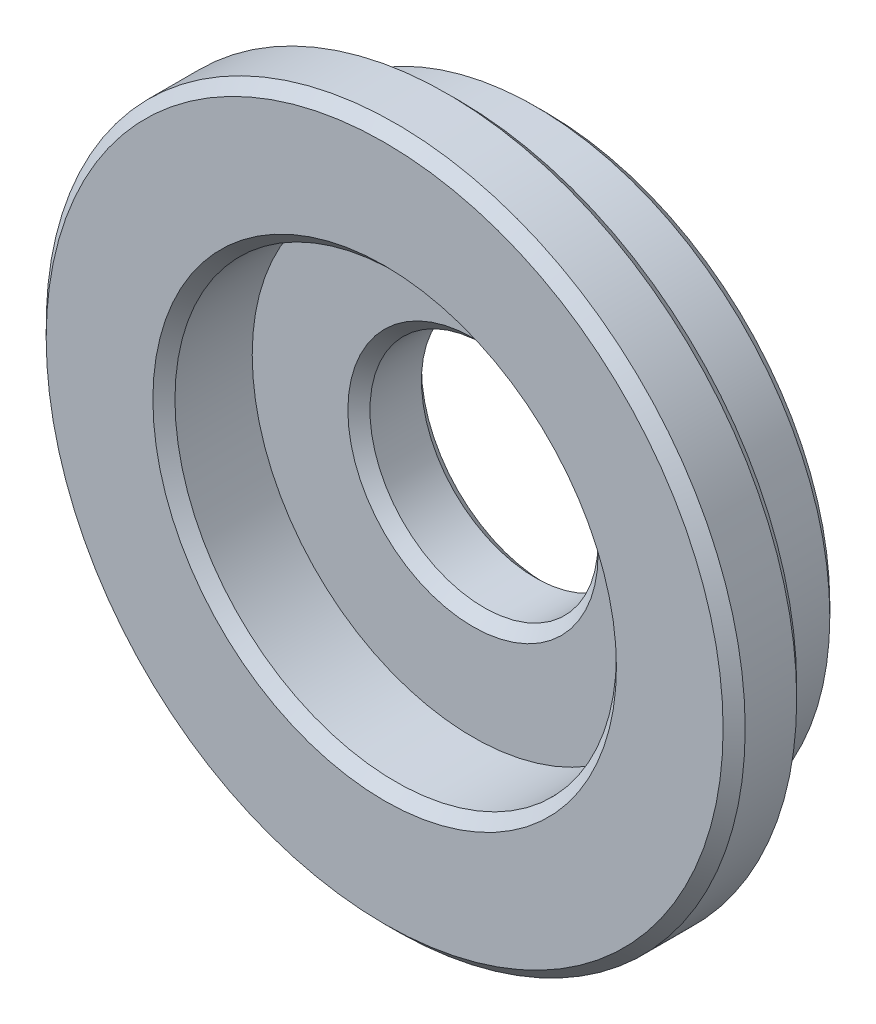
ISO-10303-21;
HEADER;
FILE_DESCRIPTION(('STEP AP214'),'2;1');
FILE_NAME('part.step','',(''),(''),'','','');
FILE_SCHEMA(('AUTOMOTIVE_DESIGN { 1 0 10303 214 1 1 1 1 }'));
ENDSEC;
DATA;
#1=APPLICATION_CONTEXT('core data for automotive mechanical design processes');
#2=APPLICATION_PROTOCOL_DEFINITION('international standard','automotive_design',2000,#1);
#3=PRODUCT_CONTEXT('',#1,'mechanical');
#4=PRODUCT('Part','Part','',(#3));
#5=PRODUCT_RELATED_PRODUCT_CATEGORY('part','',(#4));
#6=PRODUCT_DEFINITION_FORMATION('','',#4);
#7=PRODUCT_DEFINITION_CONTEXT('part definition',#1,'design');
#8=PRODUCT_DEFINITION('design','',#6,#7);
#9=PRODUCT_DEFINITION_SHAPE('','',#8);
#10=(LENGTH_UNIT() NAMED_UNIT(*) SI_UNIT(.MILLI.,.METRE.));
#11=(NAMED_UNIT(*) PLANE_ANGLE_UNIT() SI_UNIT($,.RADIAN.));
#12=(NAMED_UNIT(*) SI_UNIT($,.STERADIAN.) SOLID_ANGLE_UNIT());
#13=UNCERTAINTY_MEASURE_WITH_UNIT(LENGTH_MEASURE(1.E-05),#10,'distance_accuracy_value','');
#14=(GEOMETRIC_REPRESENTATION_CONTEXT(3) GLOBAL_UNCERTAINTY_ASSIGNED_CONTEXT((#13)) GLOBAL_UNIT_ASSIGNED_CONTEXT((#10,
#11,#12)) REPRESENTATION_CONTEXT('',''));
#15=CARTESIAN_POINT('',(0.,0.,0.));
#16=DIRECTION('',(0.,0.,1.));
#17=DIRECTION('',(1.,0.,0.));
#18=AXIS2_PLACEMENT_3D('',#15,#16,#17);
#19=CARTESIAN_POINT('',(0.,0.,0.850000000039108));
#20=DIRECTION('',(0.,0.,1.));
#21=DIRECTION('',(1.,0.,0.));
#22=AXIS2_PLACEMENT_3D('',#19,#20,#21);
#23=CONICAL_SURFACE('',#22,3.0000000000111,0.78539816339745);
#24=CARTESIAN_POINT('',(0.,0.,1.00000000008667));
#25=DIRECTION('',(0.,0.,1.));
#26=DIRECTION('',(1.,0.,0.));
#27=AXIS2_PLACEMENT_3D('',#24,#25,#26);
#28=CIRCLE('',#27,3.15000000005866);
#29=CARTESIAN_POINT('',(3.15000000005866,0.,1.00000000008667));
#30=VERTEX_POINT('',#29);
#31=EDGE_CURVE('E10',#30,#30,#28,.T.);
#32=ORIENTED_EDGE('',*,*,#31,.T.);
#33=EDGE_LOOP('',(#32));
#34=FACE_BOUND('',#33,.T.);
#35=CARTESIAN_POINT('',(0.,0.,0.850000000039108));
#36=DIRECTION('',(0.,0.,1.));
#37=DIRECTION('',(1.,0.,0.));
#38=AXIS2_PLACEMENT_3D('',#35,#36,#37);
#39=CIRCLE('',#38,3.0000000000111);
#40=CARTESIAN_POINT('',(3.0000000000111,0.,0.850000000039108));
#41=VERTEX_POINT('',#40);
#42=EDGE_CURVE('E79',#41,#41,#39,.T.);
#43=ORIENTED_EDGE('',*,*,#42,.F.);
#44=EDGE_LOOP('',(#43));
#45=FACE_BOUND('',#44,.T.);
#46=ADVANCED_FACE('F33',(#34,#45),#23,.F.);
#47=CARTESIAN_POINT('',(3.15000000005866,0.,1.00000000008667));
#48=DIRECTION('',(0.,0.,1.));
#49=DIRECTION('',(1.,0.,0.));
#50=AXIS2_PLACEMENT_3D('',#47,#48,#49);
#51=PLANE('',#50);
#52=CARTESIAN_POINT('',(0.,0.,1.00000000008667));
#53=DIRECTION('',(0.,0.,1.));
#54=DIRECTION('',(1.,0.,0.));
#55=AXIS2_PLACEMENT_3D('',#52,#53,#54);
#56=CIRCLE('',#55,4.59999999992206);
#57=CARTESIAN_POINT('',(4.59999999992206,0.,1.00000000008667));
#58=VERTEX_POINT('',#57);
#59=EDGE_CURVE('E39',#58,#58,#56,.T.);
#60=ORIENTED_EDGE('',*,*,#59,.T.);
#61=EDGE_LOOP('',(#60));
#62=FACE_BOUND('',#61,.T.);
#63=ORIENTED_EDGE('',*,*,#31,.F.);
#64=EDGE_LOOP('',(#63));
#65=FACE_BOUND('',#64,.T.);
#66=ADVANCED_FACE('F87',(#62,#65),#51,.T.);
#67=CARTESIAN_POINT('',(0.,0.,1.00000000008667));
#68=DIRECTION('',(0.,0.,-1.));
#69=DIRECTION('',(-1.,0.,0.));
#70=AXIS2_PLACEMENT_3D('',#67,#68,#69);
#71=CONICAL_SURFACE('',#70,4.59999999992206,0.785398163397447);
#72=CARTESIAN_POINT('',(0.,0.,0.850000000032741));
#73=DIRECTION('',(0.,0.,1.));
#74=DIRECTION('',(1.,0.,0.));
#75=AXIS2_PLACEMENT_3D('',#72,#73,#74);
#76=CIRCLE('',#75,4.74999999997599);
#77=CARTESIAN_POINT('',(4.74999999997599,0.,0.850000000032741));
#78=VERTEX_POINT('',#77);
#79=EDGE_CURVE('E43',#78,#78,#76,.T.);
#80=ORIENTED_EDGE('',*,*,#79,.T.);
#81=EDGE_LOOP('',(#80));
#82=FACE_BOUND('',#81,.T.);
#83=ORIENTED_EDGE('',*,*,#59,.F.);
#84=EDGE_LOOP('',(#83));
#85=FACE_BOUND('',#84,.T.);
#86=ADVANCED_FACE('F91',(#82,#85),#71,.T.);
#87=CARTESIAN_POINT('',(0.,0.,-1.20000000003984));
#88=DIRECTION('',(0.,0.,1.));
#89=DIRECTION('',(1.,0.,0.));
#90=AXIS2_PLACEMENT_3D('',#87,#88,#89);
#91=CYLINDRICAL_SURFACE('',#90,4.74999999997599);
#92=CARTESIAN_POINT('',(0.,0.,0.150000000051932));
#93=DIRECTION('',(0.,0.,1.));
#94=DIRECTION('',(1.,0.,0.));
#95=AXIS2_PLACEMENT_3D('',#92,#93,#94);
#96=CIRCLE('',#95,4.74999999997599);
#97=CARTESIAN_POINT('',(4.74999999997599,0.,0.150000000051932));
#98=VERTEX_POINT('',#97);
#99=EDGE_CURVE('E47',#98,#98,#96,.T.);
#100=ORIENTED_EDGE('',*,*,#99,.T.);
#101=EDGE_LOOP('',(#100));
#102=FACE_BOUND('',#101,.T.);
#103=ORIENTED_EDGE('',*,*,#79,.F.);
#104=EDGE_LOOP('',(#103));
#105=FACE_BOUND('',#104,.T.);
#106=ADVANCED_FACE('F95',(#102,#105),#91,.T.);
#107=CARTESIAN_POINT('',(0.,0.,0.150000000051932));
#108=DIRECTION('',(0.,0.,1.));
#109=DIRECTION('',(1.,0.,0.));
#110=AXIS2_PLACEMENT_3D('',#107,#108,#109);
#111=CONICAL_SURFACE('',#110,4.74999999997599,0.785398163397448);
#112=CARTESIAN_POINT('',(0.,0.,3.27418214068897E-11));
#113=DIRECTION('',(0.,0.,1.));
#114=DIRECTION('',(1.,0.,0.));
#115=AXIS2_PLACEMENT_3D('',#112,#113,#114);
#116=CIRCLE('',#115,4.5999999999568);
#117=CARTESIAN_POINT('',(4.5999999999568,0.,3.27418214068897E-11));
#118=VERTEX_POINT('',#117);
#119=EDGE_CURVE('E52',#118,#118,#116,.T.);
#120=ORIENTED_EDGE('',*,*,#119,.T.);
#121=EDGE_LOOP('',(#120));
#122=FACE_BOUND('',#121,.T.);
#123=ORIENTED_EDGE('',*,*,#99,.F.);
#124=EDGE_LOOP('',(#123));
#125=FACE_BOUND('',#124,.T.);
#126=ADVANCED_FACE('F102',(#122,#125),#111,.T.);
#127=CARTESIAN_POINT('',(4.5999999999568,0.,3.27417584953995E-11));
#128=DIRECTION('',(0.,0.,-1.));
#129=DIRECTION('',(-1.,0.,0.));
#130=AXIS2_PLACEMENT_3D('',#127,#128,#129);
#131=PLANE('',#130);
#132=CARTESIAN_POINT('',(0.,0.,3.27418214068897E-11));
#133=DIRECTION('',(0.,0.,1.));
#134=DIRECTION('',(1.,0.,0.));
#135=AXIS2_PLACEMENT_3D('',#132,#133,#134);
#136=CIRCLE('',#135,3.99999999995343);
#137=CARTESIAN_POINT('',(3.99999999995343,0.,3.27418214068897E-11));
#138=VERTEX_POINT('',#137);
#139=EDGE_CURVE('E55',#138,#138,#136,.T.);
#140=ORIENTED_EDGE('',*,*,#139,.T.);
#141=EDGE_LOOP('',(#140));
#142=FACE_BOUND('',#141,.T.);
#143=ORIENTED_EDGE('',*,*,#119,.F.);
#144=EDGE_LOOP('',(#143));
#145=FACE_BOUND('',#144,.T.);
#146=ADVANCED_FACE('F106',(#142,#145),#131,.T.);
#147=CARTESIAN_POINT('',(0.,0.,-1.20000000003984));
#148=DIRECTION('',(0.,0.,1.));
#149=DIRECTION('',(1.,0.,0.));
#150=AXIS2_PLACEMENT_3D('',#147,#148,#149);
#151=CYLINDRICAL_SURFACE('',#150,3.99999999995343);
#152=CARTESIAN_POINT('',(0.,0.,-1.05000000007749));
#153=DIRECTION('',(0.,0.,1.));
#154=DIRECTION('',(1.,0.,0.));
#155=AXIS2_PLACEMENT_3D('',#152,#153,#154);
#156=CIRCLE('',#155,3.99999999995343);
#157=CARTESIAN_POINT('',(3.99999999995343,0.,-1.05000000007749));
#158=VERTEX_POINT('',#157);
#159=EDGE_CURVE('E58',#158,#158,#156,.T.);
#160=ORIENTED_EDGE('',*,*,#159,.T.);
#161=EDGE_LOOP('',(#160));
#162=FACE_BOUND('',#161,.T.);
#163=ORIENTED_EDGE('',*,*,#139,.F.);
#164=EDGE_LOOP('',(#163));
#165=FACE_BOUND('',#164,.T.);
#166=ADVANCED_FACE('F110',(#162,#165),#151,.T.);
#167=CARTESIAN_POINT('',(0.,0.,-1.05000000007749));
#168=DIRECTION('',(0.,0.,1.));
#169=DIRECTION('',(1.,0.,0.));
#170=AXIS2_PLACEMENT_3D('',#167,#168,#169);
#171=CONICAL_SURFACE('',#170,3.99999999995343,0.785398163397449);
#172=CARTESIAN_POINT('',(0.,0.,-1.20000000003984));
#173=DIRECTION('',(0.,0.,1.));
#174=DIRECTION('',(1.,0.,0.));
#175=AXIS2_PLACEMENT_3D('',#172,#173,#174);
#176=CIRCLE('',#175,3.84999999999109);
#177=CARTESIAN_POINT('',(3.84999999999109,0.,-1.20000000003984));
#178=VERTEX_POINT('',#177);
#179=EDGE_CURVE('E61',#178,#178,#176,.T.);
#180=ORIENTED_EDGE('',*,*,#179,.T.);
#181=EDGE_LOOP('',(#180));
#182=FACE_BOUND('',#181,.T.);
#183=ORIENTED_EDGE('',*,*,#159,.F.);
#184=EDGE_LOOP('',(#183));
#185=FACE_BOUND('',#184,.T.);
#186=ADVANCED_FACE('F114',(#182,#185),#171,.T.);
#187=CARTESIAN_POINT('',(3.84999999999109,0.,-1.20000000003984));
#188=DIRECTION('',(0.,0.,-1.));
#189=DIRECTION('',(-1.,0.,0.));
#190=AXIS2_PLACEMENT_3D('',#187,#188,#189);
#191=PLANE('',#190);
#192=CARTESIAN_POINT('',(0.,0.,-1.20000000003984));
#193=DIRECTION('',(0.,0.,1.));
#194=DIRECTION('',(1.,0.,0.));
#195=AXIS2_PLACEMENT_3D('',#192,#193,#194);
#196=CIRCLE('',#195,1.70000000001919);
#197=CARTESIAN_POINT('',(1.70000000001919,0.,-1.20000000003984));
#198=VERTEX_POINT('',#197);
#199=EDGE_CURVE('E64',#198,#198,#196,.T.);
#200=ORIENTED_EDGE('',*,*,#199,.T.);
#201=EDGE_LOOP('',(#200));
#202=FACE_BOUND('',#201,.T.);
#203=ORIENTED_EDGE('',*,*,#179,.F.);
#204=EDGE_LOOP('',(#203));
#205=FACE_BOUND('',#204,.T.);
#206=ADVANCED_FACE('F118',(#202,#205),#191,.T.);
#207=CARTESIAN_POINT('',(0.,0.,-1.20000000003984));
#208=DIRECTION('',(0.,0.,-1.));
#209=DIRECTION('',(-1.,0.,0.));
#210=AXIS2_PLACEMENT_3D('',#207,#208,#209);
#211=CONICAL_SURFACE('',#210,1.70000000001919,0.785398163397448);
#212=CARTESIAN_POINT('',(0.,0.,-1.05000000002065));
#213=DIRECTION('',(0.,0.,1.));
#214=DIRECTION('',(1.,0.,0.));
#215=AXIS2_PLACEMENT_3D('',#212,#213,#214);
#216=CIRCLE('',#215,1.55);
#217=CARTESIAN_POINT('',(1.55,0.,-1.05000000002065));
#218=VERTEX_POINT('',#217);
#219=EDGE_CURVE('E67',#218,#218,#216,.T.);
#220=ORIENTED_EDGE('',*,*,#219,.T.);
#221=EDGE_LOOP('',(#220));
#222=FACE_BOUND('',#221,.T.);
#223=ORIENTED_EDGE('',*,*,#199,.F.);
#224=EDGE_LOOP('',(#223));
#225=FACE_BOUND('',#224,.T.);
#226=ADVANCED_FACE('F122',(#222,#225),#211,.F.);
#227=CARTESIAN_POINT('',(0.,0.,-1.20000000003984));
#228=DIRECTION('',(0.,0.,1.));
#229=DIRECTION('',(1.,0.,0.));
#230=AXIS2_PLACEMENT_3D('',#227,#228,#229);
#231=CYLINDRICAL_SURFACE('',#230,1.55);
#232=CARTESIAN_POINT('',(0.,0.,-0.35));
#233=DIRECTION('',(0.,0.,1.));
#234=DIRECTION('',(1.,0.,0.));
#235=AXIS2_PLACEMENT_3D('',#232,#233,#234);
#236=CIRCLE('',#235,1.55);
#237=CARTESIAN_POINT('',(1.55,0.,-0.35));
#238=VERTEX_POINT('',#237);
#239=EDGE_CURVE('E70',#238,#238,#236,.T.);
#240=ORIENTED_EDGE('',*,*,#239,.T.);
#241=EDGE_LOOP('',(#240));
#242=FACE_BOUND('',#241,.T.);
#243=ORIENTED_EDGE('',*,*,#219,.F.);
#244=EDGE_LOOP('',(#243));
#245=FACE_BOUND('',#244,.T.);
#246=ADVANCED_FACE('F126',(#242,#245),#231,.F.);
#247=CARTESIAN_POINT('',(0.,0.,-0.35));
#248=DIRECTION('',(0.,0.,1.));
#249=DIRECTION('',(1.,0.,0.));
#250=AXIS2_PLACEMENT_3D('',#247,#248,#249);
#251=CONICAL_SURFACE('',#250,1.55,0.785398163397448);
#252=CARTESIAN_POINT('',(0.,0.,-0.199999999960892));
#253=DIRECTION('',(0.,0.,1.));
#254=DIRECTION('',(1.,0.,0.));
#255=AXIS2_PLACEMENT_3D('',#252,#253,#254);
#256=CIRCLE('',#255,1.70000000003911);
#257=CARTESIAN_POINT('',(1.70000000003911,0.,-0.199999999960892));
#258=VERTEX_POINT('',#257);
#259=EDGE_CURVE('E73',#258,#258,#256,.T.);
#260=ORIENTED_EDGE('',*,*,#259,.T.);
#261=EDGE_LOOP('',(#260));
#262=FACE_BOUND('',#261,.T.);
#263=ORIENTED_EDGE('',*,*,#239,.F.);
#264=EDGE_LOOP('',(#263));
#265=FACE_BOUND('',#264,.T.);
#266=ADVANCED_FACE('F130',(#262,#265),#251,.F.);
#267=CARTESIAN_POINT('',(1.70000000003911,0.,-0.199999999960892));
#268=DIRECTION('',(0.,0.,1.));
#269=DIRECTION('',(1.,0.,0.));
#270=AXIS2_PLACEMENT_3D('',#267,#268,#269);
#271=PLANE('',#270);
#272=CARTESIAN_POINT('',(0.,0.,-0.199999999960892));
#273=DIRECTION('',(0.,0.,1.));
#274=DIRECTION('',(1.,0.,0.));
#275=AXIS2_PLACEMENT_3D('',#272,#273,#274);
#276=CIRCLE('',#275,3.0000000000111);
#277=CARTESIAN_POINT('',(3.0000000000111,0.,-0.199999999960892));
#278=VERTEX_POINT('',#277);
#279=EDGE_CURVE('E76',#278,#278,#276,.T.);
#280=ORIENTED_EDGE('',*,*,#279,.T.);
#281=EDGE_LOOP('',(#280));
#282=FACE_BOUND('',#281,.T.);
#283=ORIENTED_EDGE('',*,*,#259,.F.);
#284=EDGE_LOOP('',(#283));
#285=FACE_BOUND('',#284,.T.);
#286=ADVANCED_FACE('F134',(#282,#285),#271,.T.);
#287=CARTESIAN_POINT('',(0.,0.,-1.20000000003984));
#288=DIRECTION('',(0.,0.,1.));
#289=DIRECTION('',(1.,0.,0.));
#290=AXIS2_PLACEMENT_3D('',#287,#288,#289);
#291=CYLINDRICAL_SURFACE('',#290,3.0000000000111);
#292=ORIENTED_EDGE('',*,*,#42,.T.);
#293=EDGE_LOOP('',(#292));
#294=FACE_BOUND('',#293,.T.);
#295=ORIENTED_EDGE('',*,*,#279,.F.);
#296=EDGE_LOOP('',(#295));
#297=FACE_BOUND('',#296,.T.);
#298=ADVANCED_FACE('F83',(#294,#297),#291,.F.);
#299=CLOSED_SHELL('',(#46,#66,#86,#106,#126,#146,#166,#186,#206,#226,#246,#266,#286,#298));
#300=MANIFOLD_SOLID_BREP('B2',#299);
#301=ADVANCED_BREP_SHAPE_REPRESENTATION('',(#18,#300),#14);
#302=SHAPE_DEFINITION_REPRESENTATION(#9,#301);
ENDSEC;
END-ISO-10303-21;
